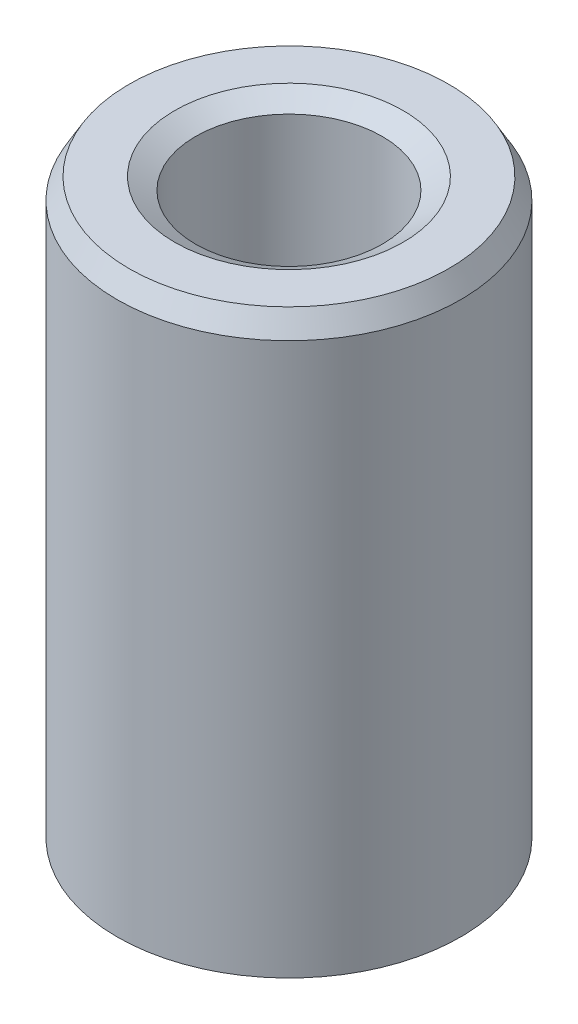
ISO-10303-21;
HEADER;
FILE_DESCRIPTION(('STEP AP214'),'2;1');
FILE_NAME('part.step','',(''),(''),'','','');
FILE_SCHEMA(('AUTOMOTIVE_DESIGN { 1 0 10303 214 1 1 1 1 }'));
ENDSEC;
DATA;
#1=APPLICATION_CONTEXT('core data for automotive mechanical design processes');
#2=APPLICATION_PROTOCOL_DEFINITION('international standard','automotive_design',2000,#1);
#3=PRODUCT_CONTEXT('',#1,'mechanical');
#4=PRODUCT('Part','Part','',(#3));
#5=PRODUCT_RELATED_PRODUCT_CATEGORY('part','',(#4));
#6=PRODUCT_DEFINITION_FORMATION('','',#4);
#7=PRODUCT_DEFINITION_CONTEXT('part definition',#1,'design');
#8=PRODUCT_DEFINITION('design','',#6,#7);
#9=PRODUCT_DEFINITION_SHAPE('','',#8);
#10=(LENGTH_UNIT() NAMED_UNIT(*) SI_UNIT(.MILLI.,.METRE.));
#11=(NAMED_UNIT(*) PLANE_ANGLE_UNIT() SI_UNIT($,.RADIAN.));
#12=(NAMED_UNIT(*) SI_UNIT($,.STERADIAN.) SOLID_ANGLE_UNIT());
#13=UNCERTAINTY_MEASURE_WITH_UNIT(LENGTH_MEASURE(1.E-05),#10,'distance_accuracy_value','');
#14=(GEOMETRIC_REPRESENTATION_CONTEXT(3) GLOBAL_UNCERTAINTY_ASSIGNED_CONTEXT((#13)) GLOBAL_UNIT_ASSIGNED_CONTEXT((#10,
#11,#12)) REPRESENTATION_CONTEXT('',''));
#15=CARTESIAN_POINT('',(0.,0.,0.));
#16=DIRECTION('',(0.,0.,1.));
#17=DIRECTION('',(1.,0.,0.));
#18=AXIS2_PLACEMENT_3D('',#15,#16,#17);
#19=CARTESIAN_POINT('',(0.,110.6097713115,0.));
#20=DIRECTION('',(0.,-1.,0.));
#21=DIRECTION('',(0.,0.,-1.));
#22=AXIS2_PLACEMENT_3D('',#19,#20,#21);
#23=CYLINDRICAL_SURFACE('',#22,32.5);
#24=CARTESIAN_POINT('',(0.,2.27448141471542,0.));
#25=DIRECTION('',(0.,1.,0.));
#26=DIRECTION('',(0.,0.,1.));
#27=AXIS2_PLACEMENT_3D('',#24,#25,#26);
#28=CIRCLE('',#27,32.5);
#29=CARTESIAN_POINT('',(0.,2.27448141471542,32.5));
#30=VERTEX_POINT('',#29);
#31=EDGE_CURVE('E10',#30,#30,#28,.T.);
#32=ORIENTED_EDGE('',*,*,#31,.T.);
#33=EDGE_LOOP('',(#32));
#34=FACE_BOUND('',#33,.T.);
#35=CARTESIAN_POINT('',(0.,106.670253940341,0.));
#36=DIRECTION('',(0.,1.,0.));
#37=DIRECTION('',(0.,0.,1.));
#38=AXIS2_PLACEMENT_3D('',#35,#36,#37);
#39=CIRCLE('',#38,32.5);
#40=CARTESIAN_POINT('',(0.,106.670253940341,32.5));
#41=VERTEX_POINT('',#40);
#42=EDGE_CURVE('E50',#41,#41,#39,.F.);
#43=ORIENTED_EDGE('',*,*,#42,.T.);
#44=EDGE_LOOP('',(#43));
#45=FACE_BOUND('',#44,.T.);
#46=ADVANCED_FACE('F39',(#34,#45),#23,.T.);
#47=CARTESIAN_POINT('',(0.,110.6097713115,0.));
#48=DIRECTION('',(0.,1.,0.));
#49=DIRECTION('',(0.,0.,1.));
#50=AXIS2_PLACEMENT_3D('',#47,#48,#49);
#51=PLANE('',#50);
#52=CARTESIAN_POINT('',(0.,110.6097713115,0.));
#53=DIRECTION('',(0.,1.,0.));
#54=DIRECTION('',(0.,0.,1.));
#55=AXIS2_PLACEMENT_3D('',#52,#53,#54);
#56=CIRCLE('',#55,21.5995055555304);
#57=CARTESIAN_POINT('',(0.,110.6097713115,21.5995055555304));
#58=VERTEX_POINT('',#57);
#59=EDGE_CURVE('E58',#58,#58,#56,.F.);
#60=ORIENTED_EDGE('',*,*,#59,.T.);
#61=EDGE_LOOP('',(#60));
#62=FACE_BOUND('',#61,.T.);
#63=CARTESIAN_POINT('',(0.,110.6097713115,0.));
#64=DIRECTION('',(0.,1.,0.));
#65=DIRECTION('',(0.,0.,1.));
#66=AXIS2_PLACEMENT_3D('',#63,#64,#65);
#67=CIRCLE('',#66,30.2255185852846);
#68=CARTESIAN_POINT('',(0.,110.6097713115,30.2255185852846));
#69=VERTEX_POINT('',#68);
#70=EDGE_CURVE('E61',#69,#69,#67,.T.);
#71=ORIENTED_EDGE('',*,*,#70,.T.);
#72=EDGE_LOOP('',(#71));
#73=FACE_BOUND('',#72,.T.);
#74=ADVANCED_FACE('F88',(#62,#73),#51,.T.);
#75=CARTESIAN_POINT('',(0.,0.,0.));
#76=DIRECTION('',(0.,1.,0.));
#77=DIRECTION('',(0.,0.,1.));
#78=AXIS2_PLACEMENT_3D('',#75,#76,#77);
#79=PLANE('',#78);
#80=CARTESIAN_POINT('',(0.,0.,0.));
#81=DIRECTION('',(0.,1.,0.));
#82=DIRECTION('',(0.,0.,1.));
#83=AXIS2_PLACEMENT_3D('',#80,#81,#82);
#84=CIRCLE('',#83,19.9344695990875);
#85=CARTESIAN_POINT('',(0.,0.,19.9344695990875));
#86=VERTEX_POINT('',#85);
#87=EDGE_CURVE('E51',#86,#86,#84,.T.);
#88=ORIENTED_EDGE('',*,*,#87,.T.);
#89=EDGE_LOOP('',(#88));
#90=FACE_BOUND('',#89,.T.);
#91=CARTESIAN_POINT('',(0.,0.,0.));
#92=DIRECTION('',(0.,1.,0.));
#93=DIRECTION('',(0.,0.,1.));
#94=AXIS2_PLACEMENT_3D('',#91,#92,#93);
#95=CIRCLE('',#94,28.5604826288417);
#96=CARTESIAN_POINT('',(0.,0.,28.5604826288417));
#97=VERTEX_POINT('',#96);
#98=EDGE_CURVE('E54',#97,#97,#95,.F.);
#99=ORIENTED_EDGE('',*,*,#98,.T.);
#100=EDGE_LOOP('',(#99));
#101=FACE_BOUND('',#100,.T.);
#102=ADVANCED_FACE('F83',(#90,#101),#79,.F.);
#103=CARTESIAN_POINT('',(0.,110.6097713115,0.));
#104=DIRECTION('',(0.,-1.,0.));
#105=DIRECTION('',(0.,0.,-1.));
#106=AXIS2_PLACEMENT_3D('',#103,#104,#105);
#107=CYLINDRICAL_SURFACE('',#106,17.6599881843721);
#108=CARTESIAN_POINT('',(0.,108.335289896784,0.));
#109=DIRECTION('',(0.,1.,0.));
#110=DIRECTION('',(0.,0.,1.));
#111=AXIS2_PLACEMENT_3D('',#108,#109,#110);
#112=CIRCLE('',#111,17.6599881843721);
#113=CARTESIAN_POINT('',(0.,108.335289896784,17.6599881843721));
#114=VERTEX_POINT('',#113);
#115=EDGE_CURVE('E67',#114,#114,#112,.T.);
#116=ORIENTED_EDGE('',*,*,#115,.T.);
#117=EDGE_LOOP('',(#116));
#118=FACE_BOUND('',#117,.T.);
#119=CARTESIAN_POINT('',(0.,3.93951737115829,0.));
#120=DIRECTION('',(0.,1.,0.));
#121=DIRECTION('',(0.,0.,1.));
#122=AXIS2_PLACEMENT_3D('',#119,#120,#121);
#123=CIRCLE('',#122,17.6599881843721);
#124=CARTESIAN_POINT('',(0.,3.93951737115829,17.6599881843721));
#125=VERTEX_POINT('',#124);
#126=EDGE_CURVE('E69',#125,#125,#123,.F.);
#127=ORIENTED_EDGE('',*,*,#126,.T.);
#128=EDGE_LOOP('',(#127));
#129=FACE_BOUND('',#128,.T.);
#130=ADVANCED_FACE('F71',(#118,#129),#107,.F.);
#131=CARTESIAN_POINT('',(0.,108.335289896784,0.));
#132=DIRECTION('',(0.,1.,0.));
#133=DIRECTION('',(0.,0.,1.));
#134=AXIS2_PLACEMENT_3D('',#131,#132,#133);
#135=CONICAL_SURFACE('',#134,17.6599881843721,1.0471975511966);
#136=CARTESIAN_POINT('',(0.,110.6097713115,21.5995055555304));
#137=CARTESIAN_POINT('',(0.,110.586078796763,21.5584689162475));
#138=CARTESIAN_POINT('',(0.,110.562386282026,21.5174322769646));
#139=CARTESIAN_POINT('',(0.,110.515001252553,21.4353589983988));
#140=CARTESIAN_POINT('',(0.,110.491308737817,21.3943223591159));
#141=CARTESIAN_POINT('',(0.,110.443923708343,21.3122490805501));
#142=CARTESIAN_POINT('',(0.,110.420231193607,21.2712124412672));
#143=CARTESIAN_POINT('',(0.,110.372846164133,21.1891391627014));
#144=CARTESIAN_POINT('',(0.,110.349153649397,21.1481025234185));
#145=CARTESIAN_POINT('',(0.,110.301768619924,21.0660292448527));
#146=CARTESIAN_POINT('',(0.,110.278076105187,21.0249926055698));
#147=CARTESIAN_POINT('',(0.,110.230691075714,20.942919327004));
#148=CARTESIAN_POINT('',(0.,110.206998560977,20.9018826877211));
#149=CARTESIAN_POINT('',(0.,110.159613531504,20.8198094091553));
#150=CARTESIAN_POINT('',(0.,110.135921016767,20.7787727698724));
#151=CARTESIAN_POINT('',(0.,110.088535987294,20.6966994913066));
#152=CARTESIAN_POINT('',(0.,110.064843472557,20.6556628520237));
#153=CARTESIAN_POINT('',(0.,110.017458443084,20.5735895734579));
#154=CARTESIAN_POINT('',(0.,109.993765928348,20.532552934175));
#155=CARTESIAN_POINT('',(0.,109.946380898874,20.4504796556092));
#156=CARTESIAN_POINT('',(0.,109.922688384138,20.4094430163263));
#157=CARTESIAN_POINT('',(0.,109.875303354664,20.3273697377605));
#158=CARTESIAN_POINT('',(0.,109.851610839928,20.2863330984776));
#159=CARTESIAN_POINT('',(0.,109.804225810455,20.2042598199118));
#160=CARTESIAN_POINT('',(0.,109.780533295718,20.1632231806289));
#161=CARTESIAN_POINT('',(0.,109.733148266245,20.0811499020631));
#162=CARTESIAN_POINT('',(0.,109.709455751508,20.0401132627802));
#163=CARTESIAN_POINT('',(0.,109.662070722035,19.9580399842144));
#164=CARTESIAN_POINT('',(0.,109.638378207298,19.9170033449315));
#165=CARTESIAN_POINT('',(0.,109.590993177825,19.8349300663657));
#166=CARTESIAN_POINT('',(0.,109.567300663088,19.7938934270828));
#167=CARTESIAN_POINT('',(0.,109.519915633615,19.711820148517));
#168=CARTESIAN_POINT('',(0.,109.496223118879,19.6707835092341));
#169=CARTESIAN_POINT('',(0.,109.448838089405,19.5887102306683));
#170=CARTESIAN_POINT('',(0.,109.425145574669,19.5476735913854));
#171=CARTESIAN_POINT('',(0.,109.377760545195,19.4656003128196));
#172=CARTESIAN_POINT('',(0.,109.354068030459,19.4245636735367));
#173=CARTESIAN_POINT('',(0.,109.306683000986,19.3424903949709));
#174=CARTESIAN_POINT('',(0.,109.282990486249,19.301453755688));
#175=CARTESIAN_POINT('',(0.,109.235605456776,19.2193804771223));
#176=CARTESIAN_POINT('',(0.,109.211912942039,19.1783438378393));
#177=CARTESIAN_POINT('',(0.,109.164527912566,19.0962705592736));
#178=CARTESIAN_POINT('',(0.,109.140835397829,19.0552339199907));
#179=CARTESIAN_POINT('',(0.,109.093450368356,18.9731606414249));
#180=CARTESIAN_POINT('',(0.,109.069757853619,18.932124002142));
#181=CARTESIAN_POINT('',(0.,109.022372824146,18.8500507235762));
#182=CARTESIAN_POINT('',(0.,108.99868030941,18.8090140842933));
#183=CARTESIAN_POINT('',(0.,108.951295279936,18.7269408057275));
#184=CARTESIAN_POINT('',(0.,108.9276027652,18.6859041664446));
#185=CARTESIAN_POINT('',(0.,108.880217735726,18.6038308878788));
#186=CARTESIAN_POINT('',(0.,108.85652522099,18.5627942485959));
#187=CARTESIAN_POINT('',(0.,108.809140191517,18.4807209700301));
#188=CARTESIAN_POINT('',(0.,108.78544767678,18.4396843307472));
#189=CARTESIAN_POINT('',(0.,108.738062647307,18.3576110521814));
#190=CARTESIAN_POINT('',(0.,108.71437013257,18.3165744128985));
#191=CARTESIAN_POINT('',(0.,108.666985103097,18.2345011343327));
#192=CARTESIAN_POINT('',(0.,108.64329258836,18.1934644950498));
#193=CARTESIAN_POINT('',(0.,108.595907558887,18.111391216484));
#194=CARTESIAN_POINT('',(0.,108.57221504415,18.0703545772011));
#195=CARTESIAN_POINT('',(0.,108.524830014677,17.9882812986353));
#196=CARTESIAN_POINT('',(0.,108.501137499941,17.9472446593524));
#197=CARTESIAN_POINT('',(0.,108.453752470467,17.8651713807866));
#198=CARTESIAN_POINT('',(0.,108.430059955731,17.8241347415037));
#199=CARTESIAN_POINT('',(0.,108.382674926257,17.7420614629379));
#200=CARTESIAN_POINT('',(0.,108.358982411521,17.701024823655));
#201=CARTESIAN_POINT('',(0.,108.335289896784,17.6599881843721));
#202=B_SPLINE_CURVE_WITH_KNOTS('',3,(#136,#137,#138,#139,#140,#141,#142,#143,#144,#145,#146,
#147,#148,#149,#150,#151,#152,#153,#154,#155,#156,#157,#158,#159,#160,#161,#162,#163,#164,#165,
#166,#167,#168,#169,#170,#171,#172,#173,#174,#175,#176,#177,#178,#179,#180,#181,#182,#183,#184,
#185,#186,#187,#188,#189,#190,#191,#192,#193,#194,#195,#196,#197,#198,#199,#200,#201),
.UNSPECIFIED.,.F.,.F.,(4,2,2,2,2,2,2,2,2,2,2,2,2,2,2,2,2,2,2,2,2,2,2,2,2,2,2,2,2,2,2,2,4),(0.,
0.142155088419709,0.284310176839426,0.426465265259142,0.568620353678858,0.710775442098568,
0.852930530518284,0.995085618938,1.13724070735772,1.27939579577743,1.42155088419714,
1.56370597261686,1.70586106103658,1.84801614945628,1.990171237876,2.13232632629572,
2.27448141471543,2.41663650313515,2.55879159155486,2.70094667997458,2.84310176839429,
2.985256856814,3.12741194523372,3.26956703365344,3.41172212207315,3.55387721049286,
3.69603229891258,3.83818738733229,3.98034247575201,4.12249756417172,4.26465265259144,
4.40680774101115,4.54896282943086),.UNSPECIFIED.);
#203=EDGE_CURVE('BSEAM77',#58,#114,#202,.T.);
#204=ORIENTED_EDGE('',*,*,#59,.F.);
#205=ORIENTED_EDGE('',*,*,#115,.F.);
#206=ORIENTED_EDGE('',*,*,#203,.T.);
#207=ORIENTED_EDGE('',*,*,#203,.F.);
#208=EDGE_LOOP('',(#204,#206,#205,#207));
#209=FACE_BOUND('',#208,.T.);
#210=ADVANCED_FACE('F77',(#209),#135,.F.);
#211=CARTESIAN_POINT('',(0.,0.,0.));
#212=DIRECTION('',(0.,-1.,0.));
#213=DIRECTION('',(0.,0.,-1.));
#214=AXIS2_PLACEMENT_3D('',#211,#212,#213);
#215=CONICAL_SURFACE('',#214,19.9344695990875,0.523598775598296);
#216=ORIENTED_EDGE('',*,*,#126,.F.);
#217=EDGE_LOOP('',(#216));
#218=FACE_BOUND('',#217,.T.);
#219=ORIENTED_EDGE('',*,*,#87,.F.);
#220=EDGE_LOOP('',(#219));
#221=FACE_BOUND('',#220,.T.);
#222=ADVANCED_FACE('F73',(#218,#221),#215,.F.);
#223=CARTESIAN_POINT('',(0.,2.27448141471542,0.));
#224=DIRECTION('',(0.,1.,0.));
#225=DIRECTION('',(0.,0.,1.));
#226=AXIS2_PLACEMENT_3D('',#223,#224,#225);
#227=CONICAL_SURFACE('',#226,32.5,1.0471975511966);
#228=CARTESIAN_POINT('',(0.,0.,28.5604826288417));
#229=CARTESIAN_POINT('',(0.,0.023692514736619,28.6015192681246));
#230=CARTESIAN_POINT('',(0.,0.0473850294732379,28.6425559074075));
#231=CARTESIAN_POINT('',(0.,0.0947700589464757,28.7246291859733));
#232=CARTESIAN_POINT('',(0.,0.118462573683095,28.7656658252562));
#233=CARTESIAN_POINT('',(0.,0.165847603156332,28.847739103822));
#234=CARTESIAN_POINT('',(0.,0.189540117892951,28.8887757431049));
#235=CARTESIAN_POINT('',(0.,0.23692514736619,28.9708490216707));
#236=CARTESIAN_POINT('',(0.,0.260617662102809,29.0118856609536));
#237=CARTESIAN_POINT('',(0.,0.308002691576046,29.0939589395194));
#238=CARTESIAN_POINT('',(0.,0.331695206312665,29.1349955788023));
#239=CARTESIAN_POINT('',(0.,0.379080235785903,29.2170688573681));
#240=CARTESIAN_POINT('',(0.,0.402772750522523,29.258105496651));
#241=CARTESIAN_POINT('',(0.,0.45015777999576,29.3401787752168));
#242=CARTESIAN_POINT('',(0.,0.473850294732379,29.3812154144997));
#243=CARTESIAN_POINT('',(0.,0.521235324205617,29.4632886930655));
#244=CARTESIAN_POINT('',(0.,0.544927838942236,29.5043253323484));
#245=CARTESIAN_POINT('',(0.,0.592312868415474,29.5863986109142));
#246=CARTESIAN_POINT('',(0.,0.616005383152093,29.6274352501971));
#247=CARTESIAN_POINT('',(0.,0.663390412625331,29.7095085287629));
#248=CARTESIAN_POINT('',(0.,0.68708292736195,29.7505451680458));
#249=CARTESIAN_POINT('',(0.,0.734467956835188,29.8326184466116));
#250=CARTESIAN_POINT('',(0.,0.758160471571807,29.8736550858945));
#251=CARTESIAN_POINT('',(0.,0.805545501045045,29.9557283644603));
#252=CARTESIAN_POINT('',(0.,0.829238015781664,29.9967650037432));
#253=CARTESIAN_POINT('',(0.,0.876623045254902,30.078838282309));
#254=CARTESIAN_POINT('',(0.,0.900315559991521,30.1198749215919));
#255=CARTESIAN_POINT('',(0.,0.947700589464759,30.2019482001577));
#256=CARTESIAN_POINT('',(0.,0.971393104201378,30.2429848394406));
#257=CARTESIAN_POINT('',(0.,1.01877813367462,30.3250581180064));
#258=CARTESIAN_POINT('',(0.,1.04247064841124,30.3660947572893));
#259=CARTESIAN_POINT('',(0.,1.08985567788447,30.4481680358551));
#260=CARTESIAN_POINT('',(0.,1.11354819262109,30.489204675138));
#261=CARTESIAN_POINT('',(0.,1.16093322209433,30.5712779537038));
#262=CARTESIAN_POINT('',(0.,1.18462573683095,30.6123145929867));
#263=CARTESIAN_POINT('',(0.,1.23201076630419,30.6943878715525));
#264=CARTESIAN_POINT('',(0.,1.25570328104081,30.7354245108354));
#265=CARTESIAN_POINT('',(0.,1.30308831051404,30.8174977894012));
#266=CARTESIAN_POINT('',(0.,1.32678082525066,30.8585344286841));
#267=CARTESIAN_POINT('',(0.,1.3741658547239,30.9406077072498));
#268=CARTESIAN_POINT('',(0.,1.39785836946052,30.9816443465328));
#269=CARTESIAN_POINT('',(0.,1.44524339893376,31.0637176250985));
#270=CARTESIAN_POINT('',(0.,1.46893591367038,31.1047542643814));
#271=CARTESIAN_POINT('',(0.,1.51632094314362,31.1868275429472));
#272=CARTESIAN_POINT('',(0.,1.54001345788023,31.2278641822301));
#273=CARTESIAN_POINT('',(0.,1.58739848735347,31.3099374607959));
#274=CARTESIAN_POINT('',(0.,1.61109100209009,31.3509741000788));
#275=CARTESIAN_POINT('',(0.,1.65847603156333,31.4330473786446));
#276=CARTESIAN_POINT('',(0.,1.68216854629995,31.4740840179275));
#277=CARTESIAN_POINT('',(0.,1.72955357577319,31.5561572964933));
#278=CARTESIAN_POINT('',(0.,1.75324609050981,31.5971939357762));
#279=CARTESIAN_POINT('',(0.,1.80063111998304,31.679267214342));
#280=CARTESIAN_POINT('',(0.,1.82432363471966,31.7203038536249));
#281=CARTESIAN_POINT('',(0.,1.8717086641929,31.8023771321907));
#282=CARTESIAN_POINT('',(0.,1.89540117892952,31.8434137714736));
#283=CARTESIAN_POINT('',(0.,1.94278620840276,31.9254870500394));
#284=CARTESIAN_POINT('',(0.,1.96647872313938,31.9665236893223));
#285=CARTESIAN_POINT('',(0.,2.01386375261261,32.0485969678881));
#286=CARTESIAN_POINT('',(0.,2.03755626734923,32.089633607171));
#287=CARTESIAN_POINT('',(0.,2.08494129682247,32.1717068857368));
#288=CARTESIAN_POINT('',(0.,2.10863381155909,32.2127435250197));
#289=CARTESIAN_POINT('',(0.,2.15601884103233,32.2948168035855));
#290=CARTESIAN_POINT('',(0.,2.17971135576895,32.3358534428684));
#291=CARTESIAN_POINT('',(0.,2.22709638524218,32.4179267214342));
#292=CARTESIAN_POINT('',(0.,2.2507888999788,32.4589633607171));
#293=CARTESIAN_POINT('',(0.,2.27448141471542,32.5));
#294=B_SPLINE_CURVE_WITH_KNOTS('',3,(#228,#229,#230,#231,#232,#233,#234,#235,#236,#237,#238,
#239,#240,#241,#242,#243,#244,#245,#246,#247,#248,#249,#250,#251,#252,#253,#254,#255,#256,#257,
#258,#259,#260,#261,#262,#263,#264,#265,#266,#267,#268,#269,#270,#271,#272,#273,#274,#275,#276,
#277,#278,#279,#280,#281,#282,#283,#284,#285,#286,#287,#288,#289,#290,#291,#292,#293),
.UNSPECIFIED.,.F.,.F.,(4,2,2,2,2,2,2,2,2,2,2,2,2,2,2,2,2,2,2,2,2,2,2,2,2,2,2,2,2,2,2,2,4),(0.,
0.142155088419712,0.284310176839426,0.426465265259141,0.568620353678855,0.71077544209857,
0.852930530518284,0.995085618938002,1.13724070735772,1.27939579577743,1.42155088419715,
1.56370597261686,1.70586106103658,1.84801614945629,1.990171237876,2.13232632629572,
2.27448141471543,2.41663650313515,2.55879159155486,2.70094667997458,2.84310176839429,
2.98525685681401,3.12741194523372,3.26956703365343,3.41172212207315,3.55387721049286,
3.69603229891258,3.83818738733229,3.98034247575201,4.12249756417172,4.26465265259144,
4.40680774101115,4.54896282943087),.UNSPECIFIED.);
#295=EDGE_CURVE('BSEAM76',#97,#30,#294,.T.);
#296=ORIENTED_EDGE('',*,*,#98,.F.);
#297=ORIENTED_EDGE('',*,*,#31,.F.);
#298=ORIENTED_EDGE('',*,*,#295,.T.);
#299=ORIENTED_EDGE('',*,*,#295,.F.);
#300=EDGE_LOOP('',(#296,#298,#297,#299));
#301=FACE_BOUND('',#300,.T.);
#302=ADVANCED_FACE('F76',(#301),#227,.T.);
#303=CARTESIAN_POINT('',(0.,110.6097713115,0.));
#304=DIRECTION('',(0.,-1.,0.));
#305=DIRECTION('',(0.,0.,-1.));
#306=AXIS2_PLACEMENT_3D('',#303,#304,#305);
#307=CONICAL_SURFACE('',#306,30.2255185852846,0.523598775598297);
#308=ORIENTED_EDGE('',*,*,#42,.F.);
#309=EDGE_LOOP('',(#308));
#310=FACE_BOUND('',#309,.T.);
#311=ORIENTED_EDGE('',*,*,#70,.F.);
#312=EDGE_LOOP('',(#311));
#313=FACE_BOUND('',#312,.T.);
#314=ADVANCED_FACE('F45',(#310,#313),#307,.T.);
#315=CLOSED_SHELL('',(#46,#74,#102,#130,#210,#222,#302,#314));
#316=MANIFOLD_SOLID_BREP('B2',#315);
#317=ADVANCED_BREP_SHAPE_REPRESENTATION('',(#18,#316),#14);
#318=SHAPE_DEFINITION_REPRESENTATION(#9,#317);
ENDSEC;
END-ISO-10303-21;
